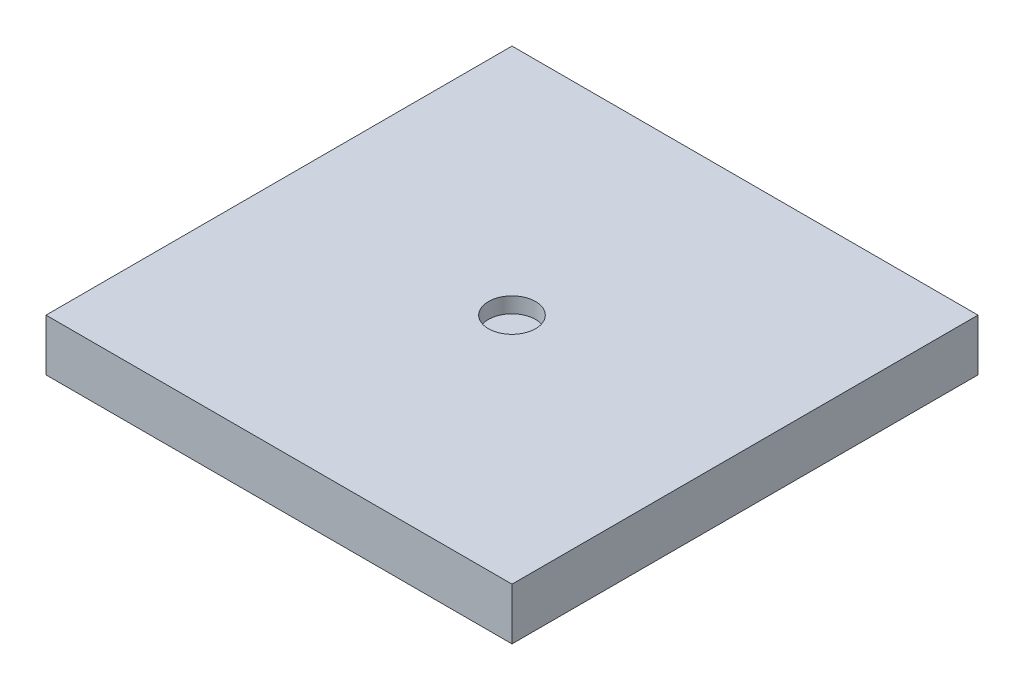
ISO-10303-21;
HEADER;
FILE_DESCRIPTION(('STEP AP214'),'2;1');
FILE_NAME('part.step','',(''),(''),'','','');
FILE_SCHEMA(('AUTOMOTIVE_DESIGN { 1 0 10303 214 1 1 1 1 }'));
ENDSEC;
DATA;
#1=APPLICATION_CONTEXT('core data for automotive mechanical design processes');
#2=APPLICATION_PROTOCOL_DEFINITION('international standard','automotive_design',2000,#1);
#3=PRODUCT_CONTEXT('',#1,'mechanical');
#4=PRODUCT('Part','Part','',(#3));
#5=PRODUCT_RELATED_PRODUCT_CATEGORY('part','',(#4));
#6=PRODUCT_DEFINITION_FORMATION('','',#4);
#7=PRODUCT_DEFINITION_CONTEXT('part definition',#1,'design');
#8=PRODUCT_DEFINITION('design','',#6,#7);
#9=PRODUCT_DEFINITION_SHAPE('','',#8);
#10=(LENGTH_UNIT() NAMED_UNIT(*) SI_UNIT(.MILLI.,.METRE.));
#11=(NAMED_UNIT(*) PLANE_ANGLE_UNIT() SI_UNIT($,.RADIAN.));
#12=(NAMED_UNIT(*) SI_UNIT($,.STERADIAN.) SOLID_ANGLE_UNIT());
#13=UNCERTAINTY_MEASURE_WITH_UNIT(LENGTH_MEASURE(1.E-05),#10,'distance_accuracy_value','');
#14=(GEOMETRIC_REPRESENTATION_CONTEXT(3) GLOBAL_UNCERTAINTY_ASSIGNED_CONTEXT((#13)) GLOBAL_UNIT_ASSIGNED_CONTEXT((#10,
#11,#12)) REPRESENTATION_CONTEXT('',''));
#15=CARTESIAN_POINT('',(0.,0.,0.));
#16=DIRECTION('',(0.,0.,1.));
#17=DIRECTION('',(1.,0.,0.));
#18=AXIS2_PLACEMENT_3D('',#15,#16,#17);
#19=CARTESIAN_POINT('',(11.43,2.54,11.43));
#20=DIRECTION('',(-1.,0.,0.));
#21=DIRECTION('',(0.,0.,1.));
#22=AXIS2_PLACEMENT_3D('',#19,#20,#21);
#23=PLANE('',#22);
#24=DIRECTION('',(0.,0.,-1.));
#25=VECTOR('',#24,1.);
#26=CARTESIAN_POINT('',(11.43,0.,11.43));
#27=LINE('',#26,#25);
#28=CARTESIAN_POINT('',(11.43,0.,11.43));
#29=VERTEX_POINT('',#28);
#30=CARTESIAN_POINT('',(11.43,0.,-11.43));
#31=VERTEX_POINT('',#30);
#32=EDGE_CURVE('E96',#29,#31,#27,.T.);
#33=ORIENTED_EDGE('',*,*,#32,.T.);
#34=DIRECTION('',(0.,-1.,0.));
#35=VECTOR('',#34,1.);
#36=CARTESIAN_POINT('',(11.43,2.54,-11.43));
#37=LINE('',#36,#35);
#38=CARTESIAN_POINT('',(11.43,2.54,-11.43));
#39=VERTEX_POINT('',#38);
#40=EDGE_CURVE('E11',#39,#31,#37,.T.);
#41=ORIENTED_EDGE('',*,*,#40,.F.);
#42=DIRECTION('',(0.,0.,-1.));
#43=VECTOR('',#42,1.);
#44=CARTESIAN_POINT('',(11.43,2.54,11.43));
#45=LINE('',#44,#43);
#46=CARTESIAN_POINT('',(11.43,2.54,11.43));
#47=VERTEX_POINT('',#46);
#48=EDGE_CURVE('E84',#47,#39,#45,.T.);
#49=ORIENTED_EDGE('',*,*,#48,.F.);
#50=DIRECTION('',(0.,-1.,0.));
#51=VECTOR('',#50,1.);
#52=CARTESIAN_POINT('',(11.43,2.54,11.43));
#53=LINE('',#52,#51);
#54=EDGE_CURVE('E92',#47,#29,#53,.T.);
#55=ORIENTED_EDGE('',*,*,#54,.T.);
#56=EDGE_LOOP('',(#33,#41,#49,#55));
#57=FACE_BOUND('',#56,.T.);
#58=ADVANCED_FACE('F33',(#57),#23,.F.);
#59=CARTESIAN_POINT('',(-11.43,2.54,-11.43));
#60=DIRECTION('',(0.,0.,1.));
#61=DIRECTION('',(1.,0.,0.));
#62=AXIS2_PLACEMENT_3D('',#59,#60,#61);
#63=PLANE('',#62);
#64=DIRECTION('',(-1.,0.,0.));
#65=VECTOR('',#64,1.);
#66=CARTESIAN_POINT('',(-11.43,0.,-11.43));
#67=LINE('',#66,#65);
#68=CARTESIAN_POINT('',(-11.43,0.,-11.43));
#69=VERTEX_POINT('',#68);
#70=EDGE_CURVE('E88',#31,#69,#67,.T.);
#71=ORIENTED_EDGE('',*,*,#70,.T.);
#72=DIRECTION('',(0.,-1.,0.));
#73=VECTOR('',#72,1.);
#74=CARTESIAN_POINT('',(-11.43,2.54,-11.43));
#75=LINE('',#74,#73);
#76=CARTESIAN_POINT('',(-11.43,2.54,-11.43));
#77=VERTEX_POINT('',#76);
#78=EDGE_CURVE('E41',#77,#69,#75,.T.);
#79=ORIENTED_EDGE('',*,*,#78,.F.);
#80=DIRECTION('',(-1.,0.,0.));
#81=VECTOR('',#80,1.);
#82=CARTESIAN_POINT('',(-11.43,2.54,-11.43));
#83=LINE('',#82,#81);
#84=EDGE_CURVE('E79',#39,#77,#83,.T.);
#85=ORIENTED_EDGE('',*,*,#84,.F.);
#86=ORIENTED_EDGE('',*,*,#40,.T.);
#87=EDGE_LOOP('',(#71,#79,#85,#86));
#88=FACE_BOUND('',#87,.T.);
#89=ADVANCED_FACE('F87',(#88),#63,.F.);
#90=CARTESIAN_POINT('',(-11.43,2.54,11.43));
#91=DIRECTION('',(1.,0.,0.));
#92=DIRECTION('',(0.,0.,-1.));
#93=AXIS2_PLACEMENT_3D('',#90,#91,#92);
#94=PLANE('',#93);
#95=DIRECTION('',(0.,0.,1.));
#96=VECTOR('',#95,1.);
#97=CARTESIAN_POINT('',(-11.43,0.,11.43));
#98=LINE('',#97,#96);
#99=CARTESIAN_POINT('',(-11.43,0.,11.43));
#100=VERTEX_POINT('',#99);
#101=EDGE_CURVE('E66',#69,#100,#98,.T.);
#102=ORIENTED_EDGE('',*,*,#101,.T.);
#103=DIRECTION('',(0.,-1.,0.));
#104=VECTOR('',#103,1.);
#105=CARTESIAN_POINT('',(-11.43,2.54,11.43));
#106=LINE('',#105,#104);
#107=CARTESIAN_POINT('',(-11.43,2.54,11.43));
#108=VERTEX_POINT('',#107);
#109=EDGE_CURVE('E89',#108,#100,#106,.T.);
#110=ORIENTED_EDGE('',*,*,#109,.F.);
#111=DIRECTION('',(0.,0.,1.));
#112=VECTOR('',#111,1.);
#113=CARTESIAN_POINT('',(-11.43,2.54,11.43));
#114=LINE('',#113,#112);
#115=EDGE_CURVE('E82',#77,#108,#114,.T.);
#116=ORIENTED_EDGE('',*,*,#115,.F.);
#117=ORIENTED_EDGE('',*,*,#78,.T.);
#118=EDGE_LOOP('',(#102,#110,#116,#117));
#119=FACE_BOUND('',#118,.T.);
#120=ADVANCED_FACE('F90',(#119),#94,.F.);
#121=CARTESIAN_POINT('',(-11.43,2.54,11.43));
#122=DIRECTION('',(0.,0.,-1.));
#123=DIRECTION('',(-1.,0.,0.));
#124=AXIS2_PLACEMENT_3D('',#121,#122,#123);
#125=PLANE('',#124);
#126=DIRECTION('',(1.,0.,0.));
#127=VECTOR('',#126,1.);
#128=CARTESIAN_POINT('',(-11.43,0.,11.43));
#129=LINE('',#128,#127);
#130=EDGE_CURVE('E72',#100,#29,#129,.T.);
#131=ORIENTED_EDGE('',*,*,#130,.T.);
#132=ORIENTED_EDGE('',*,*,#54,.F.);
#133=DIRECTION('',(1.,0.,0.));
#134=VECTOR('',#133,1.);
#135=CARTESIAN_POINT('',(-11.43,2.54,11.43));
#136=LINE('',#135,#134);
#137=EDGE_CURVE('E49',#108,#47,#136,.T.);
#138=ORIENTED_EDGE('',*,*,#137,.F.);
#139=ORIENTED_EDGE('',*,*,#109,.T.);
#140=EDGE_LOOP('',(#131,#132,#138,#139));
#141=FACE_BOUND('',#140,.T.);
#142=ADVANCED_FACE('F104',(#141),#125,.F.);
#143=CARTESIAN_POINT('',(0.,2.54,0.));
#144=DIRECTION('',(0.,-1.,0.));
#145=DIRECTION('',(0.,0.,-1.));
#146=AXIS2_PLACEMENT_3D('',#143,#144,#145);
#147=PLANE('',#146);
#148=CARTESIAN_POINT('',(0.,2.54,0.));
#149=DIRECTION('',(0.,1.,0.));
#150=DIRECTION('',(0.,0.,1.));
#151=AXIS2_PLACEMENT_3D('',#148,#149,#150);
#152=CIRCLE('',#151,1.15653030718025);
#153=CARTESIAN_POINT('',(0.,2.54,1.15653030718025));
#154=VERTEX_POINT('',#153);
#155=EDGE_CURVE('E110',#154,#154,#152,.T.);
#156=ORIENTED_EDGE('',*,*,#155,.F.);
#157=EDGE_LOOP('',(#156));
#158=FACE_BOUND('',#157,.T.);
#159=ORIENTED_EDGE('',*,*,#48,.T.);
#160=ORIENTED_EDGE('',*,*,#84,.T.);
#161=ORIENTED_EDGE('',*,*,#115,.T.);
#162=ORIENTED_EDGE('',*,*,#137,.T.);
#163=EDGE_LOOP('',(#159,#160,#161,#162));
#164=FACE_BOUND('',#163,.T.);
#165=ADVANCED_FACE('F80',(#158,#164),#147,.F.);
#166=CARTESIAN_POINT('',(0.,0.,0.));
#167=DIRECTION('',(0.,-1.,0.));
#168=DIRECTION('',(0.,0.,-1.));
#169=AXIS2_PLACEMENT_3D('',#166,#167,#168);
#170=PLANE('',#169);
#171=ORIENTED_EDGE('',*,*,#32,.F.);
#172=ORIENTED_EDGE('',*,*,#130,.F.);
#173=ORIENTED_EDGE('',*,*,#101,.F.);
#174=ORIENTED_EDGE('',*,*,#70,.F.);
#175=EDGE_LOOP('',(#171,#172,#173,#174));
#176=FACE_BOUND('',#175,.T.);
#177=ADVANCED_FACE('F107',(#176),#170,.T.);
#178=CARTESIAN_POINT('',(0.,1.778,0.));
#179=DIRECTION('',(0.,1.,0.));
#180=DIRECTION('',(0.,0.,1.));
#181=AXIS2_PLACEMENT_3D('',#178,#179,#180);
#182=CYLINDRICAL_SURFACE('',#181,1.15653030718025);
#183=CARTESIAN_POINT('',(0.,1.778,0.));
#184=DIRECTION('',(0.,1.,0.));
#185=DIRECTION('',(0.,0.,1.));
#186=AXIS2_PLACEMENT_3D('',#183,#184,#185);
#187=CIRCLE('',#186,1.15653030718025);
#188=CARTESIAN_POINT('',(0.,1.778,1.15653030718025));
#189=VERTEX_POINT('',#188);
#190=EDGE_CURVE('E99',#189,#189,#187,.T.);
#191=ORIENTED_EDGE('',*,*,#190,.F.);
#192=EDGE_LOOP('',(#191));
#193=FACE_BOUND('',#192,.T.);
#194=ORIENTED_EDGE('',*,*,#155,.T.);
#195=EDGE_LOOP('',(#194));
#196=FACE_BOUND('',#195,.T.);
#197=ADVANCED_FACE('F118',(#193,#196),#182,.F.);
#198=CARTESIAN_POINT('',(0.,1.778,0.));
#199=DIRECTION('',(0.,1.,0.));
#200=DIRECTION('',(0.,0.,1.));
#201=AXIS2_PLACEMENT_3D('',#198,#199,#200);
#202=PLANE('',#201);
#203=ORIENTED_EDGE('',*,*,#190,.T.);
#204=EDGE_LOOP('',(#203));
#205=FACE_BOUND('',#204,.T.);
#206=ADVANCED_FACE('F116',(#205),#202,.T.);
#207=CLOSED_SHELL('',(#58,#89,#120,#142,#165,#177,#197,#206));
#208=MANIFOLD_SOLID_BREP('B2',#207);
#209=ADVANCED_BREP_SHAPE_REPRESENTATION('',(#18,#208),#14);
#210=SHAPE_DEFINITION_REPRESENTATION(#9,#209);
ENDSEC;
END-ISO-10303-21;
